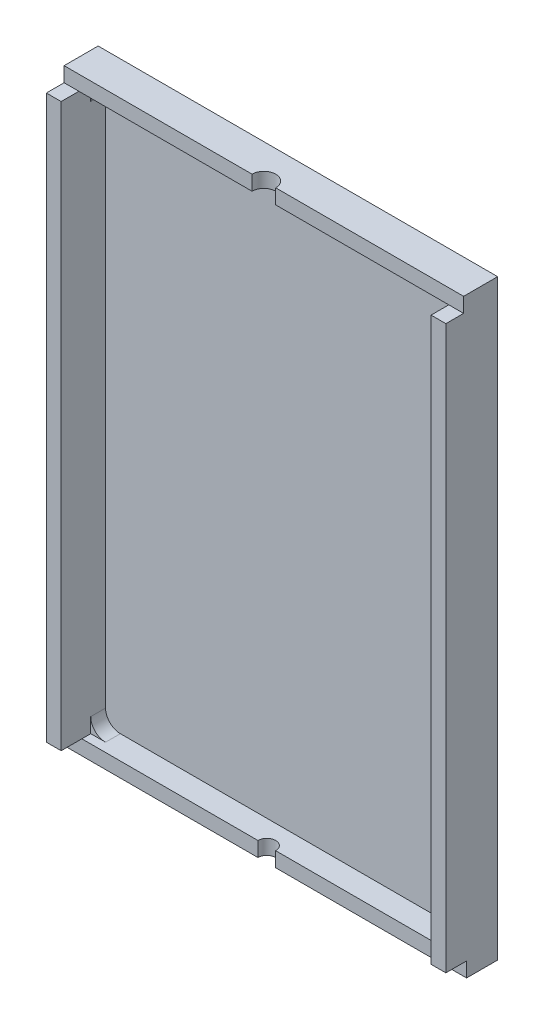
ISO-10303-21;
HEADER;
FILE_DESCRIPTION(('STEP AP214'),'2;1');
FILE_NAME('part.step','',(''),(''),'','','');
FILE_SCHEMA(('AUTOMOTIVE_DESIGN { 1 0 10303 214 1 1 1 1 }'));
ENDSEC;
DATA;
#1=APPLICATION_CONTEXT('core data for automotive mechanical design processes');
#2=APPLICATION_PROTOCOL_DEFINITION('international standard','automotive_design',2000,#1);
#3=PRODUCT_CONTEXT('',#1,'mechanical');
#4=PRODUCT('Part','Part','',(#3));
#5=PRODUCT_RELATED_PRODUCT_CATEGORY('part','',(#4));
#6=PRODUCT_DEFINITION_FORMATION('','',#4);
#7=PRODUCT_DEFINITION_CONTEXT('part definition',#1,'design');
#8=PRODUCT_DEFINITION('design','',#6,#7);
#9=PRODUCT_DEFINITION_SHAPE('','',#8);
#10=(LENGTH_UNIT() NAMED_UNIT(*) SI_UNIT(.MILLI.,.METRE.));
#11=(NAMED_UNIT(*) PLANE_ANGLE_UNIT() SI_UNIT($,.RADIAN.));
#12=(NAMED_UNIT(*) SI_UNIT($,.STERADIAN.) SOLID_ANGLE_UNIT());
#13=UNCERTAINTY_MEASURE_WITH_UNIT(LENGTH_MEASURE(1.E-05),#10,'distance_accuracy_value','');
#14=(GEOMETRIC_REPRESENTATION_CONTEXT(3) GLOBAL_UNCERTAINTY_ASSIGNED_CONTEXT((#13)) GLOBAL_UNIT_ASSIGNED_CONTEXT((#10,
#11,#12)) REPRESENTATION_CONTEXT('',''));
#15=CARTESIAN_POINT('',(0.,0.,0.));
#16=DIRECTION('',(0.,0.,1.));
#17=DIRECTION('',(1.,0.,0.));
#18=AXIS2_PLACEMENT_3D('',#15,#16,#17);
#19=CARTESIAN_POINT('',(2.,39.,1.5));
#20=DIRECTION('',(0.,-1.,0.));
#21=DIRECTION('',(0.,0.,-1.));
#22=AXIS2_PLACEMENT_3D('',#19,#20,#21);
#23=PLANE('',#22);
#24=DIRECTION('',(1.,0.,0.));
#25=VECTOR('',#24,1.);
#26=CARTESIAN_POINT('',(0.,39.,2.3));
#27=LINE('',#26,#25);
#28=CARTESIAN_POINT('',(1.,39.,2.3));
#29=VERTEX_POINT('',#28);
#30=CARTESIAN_POINT('',(12.7,39.,2.3));
#31=VERTEX_POINT('',#30);
#32=EDGE_CURVE('E295',#29,#31,#27,.T.);
#33=ORIENTED_EDGE('',*,*,#32,.F.);
#34=DIRECTION('',(0.,0.,-1.));
#35=VECTOR('',#34,1.);
#36=CARTESIAN_POINT('',(1.,39.,3.5));
#37=LINE('',#36,#35);
#38=CARTESIAN_POINT('',(1.,39.,1.5));
#39=VERTEX_POINT('',#38);
#40=EDGE_CURVE('E422',#29,#39,#37,.T.);
#41=ORIENTED_EDGE('',*,*,#40,.T.);
#42=DIRECTION('',(1.,0.,0.));
#43=VECTOR('',#42,1.);
#44=CARTESIAN_POINT('',(0.,39.,1.5));
#45=LINE('',#44,#43);
#46=CARTESIAN_POINT('',(2.,39.,1.5));
#47=VERTEX_POINT('',#46);
#48=EDGE_CURVE('E285',#39,#47,#45,.T.);
#49=ORIENTED_EDGE('',*,*,#48,.T.);
#50=DIRECTION('',(0.,0.,-1.));
#51=VECTOR('',#50,1.);
#52=CARTESIAN_POINT('',(2.,39.,1.5));
#53=LINE('',#52,#51);
#54=CARTESIAN_POINT('',(2.,39.,0.5));
#55=VERTEX_POINT('',#54);
#56=EDGE_CURVE('E353',#47,#55,#53,.T.);
#57=ORIENTED_EDGE('',*,*,#56,.T.);
#58=DIRECTION('',(-1.,0.,0.));
#59=VECTOR('',#58,1.);
#60=CARTESIAN_POINT('',(2.,39.,0.5));
#61=LINE('',#60,#59);
#62=CARTESIAN_POINT('',(25.,39.,0.5));
#63=VERTEX_POINT('',#62);
#64=EDGE_CURVE('E322',#63,#55,#61,.T.);
#65=ORIENTED_EDGE('',*,*,#64,.F.);
#66=DIRECTION('',(0.,0.,-1.));
#67=VECTOR('',#66,1.);
#68=CARTESIAN_POINT('',(25.,39.,1.5));
#69=LINE('',#68,#67);
#70=CARTESIAN_POINT('',(25.,39.,1.5));
#71=VERTEX_POINT('',#70);
#72=EDGE_CURVE('E355',#71,#63,#69,.T.);
#73=ORIENTED_EDGE('',*,*,#72,.F.);
#74=CARTESIAN_POINT('',(26.,39.,1.5));
#75=VERTEX_POINT('',#74);
#76=EDGE_CURVE('E305',#71,#75,#45,.T.);
#77=ORIENTED_EDGE('',*,*,#76,.T.);
#78=DIRECTION('',(0.,0.,-1.));
#79=VECTOR('',#78,1.);
#80=CARTESIAN_POINT('',(26.,39.,3.5));
#81=LINE('',#80,#79);
#82=CARTESIAN_POINT('',(26.,39.,2.3));
#83=VERTEX_POINT('',#82);
#84=EDGE_CURVE('E256',#83,#75,#81,.T.);
#85=ORIENTED_EDGE('',*,*,#84,.F.);
#86=CARTESIAN_POINT('',(14.3,39.,2.3));
#87=VERTEX_POINT('',#86);
#88=EDGE_CURVE('E296',#87,#83,#27,.T.);
#89=ORIENTED_EDGE('',*,*,#88,.F.);
#90=CARTESIAN_POINT('',(13.5,39.,2.3));
#91=DIRECTION('',(0.,-1.,0.));
#92=DIRECTION('',(0.,0.,-1.));
#93=AXIS2_PLACEMENT_3D('',#90,#91,#92);
#94=CIRCLE('',#93,0.800000000000001);
#95=EDGE_CURVE('E56',#31,#87,#94,.T.);
#96=ORIENTED_EDGE('',*,*,#95,.F.);
#97=EDGE_LOOP('',(#33,#41,#49,#57,#65,#73,#77,#85,#89,#96));
#98=FACE_BOUND('',#97,.T.);
#99=ADVANCED_FACE('F33',(#98),#23,.T.);
#100=CARTESIAN_POINT('',(2.,1.,1.5));
#101=DIRECTION('',(0.,1.,0.));
#102=DIRECTION('',(-1.,0.,0.));
#103=AXIS2_PLACEMENT_3D('',#100,#101,#102);
#104=PLANE('',#103);
#105=DIRECTION('',(-1.,0.,0.));
#106=VECTOR('',#105,1.);
#107=CARTESIAN_POINT('',(0.,1.,1.5));
#108=LINE('',#107,#106);
#109=CARTESIAN_POINT('',(2.,1.,1.5));
#110=VERTEX_POINT('',#109);
#111=CARTESIAN_POINT('',(1.,1.,1.5));
#112=VERTEX_POINT('',#111);
#113=EDGE_CURVE('E264',#110,#112,#108,.T.);
#114=ORIENTED_EDGE('',*,*,#113,.T.);
#115=DIRECTION('',(0.,0.,-1.));
#116=VECTOR('',#115,1.);
#117=CARTESIAN_POINT('',(1.,1.,3.5));
#118=LINE('',#117,#116);
#119=CARTESIAN_POINT('',(1.,1.,2.1));
#120=VERTEX_POINT('',#119);
#121=EDGE_CURVE('E237',#120,#112,#118,.T.);
#122=ORIENTED_EDGE('',*,*,#121,.F.);
#123=DIRECTION('',(-1.,0.,0.));
#124=VECTOR('',#123,1.);
#125=CARTESIAN_POINT('',(0.,1.,2.1));
#126=LINE('',#125,#124);
#127=CARTESIAN_POINT('',(12.9,1.,2.1));
#128=VERTEX_POINT('',#127);
#129=EDGE_CURVE('E280',#128,#120,#126,.T.);
#130=ORIENTED_EDGE('',*,*,#129,.F.);
#131=CARTESIAN_POINT('',(13.5,1.,2.1));
#132=DIRECTION('',(0.,-1.,0.));
#133=DIRECTION('',(0.,0.,-1.));
#134=AXIS2_PLACEMENT_3D('',#131,#132,#133);
#135=CIRCLE('',#134,0.6);
#136=CARTESIAN_POINT('',(14.1,1.,2.1));
#137=VERTEX_POINT('',#136);
#138=EDGE_CURVE('E48',#128,#137,#135,.T.);
#139=ORIENTED_EDGE('',*,*,#138,.T.);
#140=CARTESIAN_POINT('',(26.,1.,2.1));
#141=VERTEX_POINT('',#140);
#142=EDGE_CURVE('E279',#141,#137,#126,.T.);
#143=ORIENTED_EDGE('',*,*,#142,.F.);
#144=DIRECTION('',(0.,0.,-1.));
#145=VECTOR('',#144,1.);
#146=CARTESIAN_POINT('',(26.,1.,1.5));
#147=LINE('',#146,#145);
#148=CARTESIAN_POINT('',(26.,1.,1.5));
#149=VERTEX_POINT('',#148);
#150=EDGE_CURVE('E11',#141,#149,#147,.T.);
#151=ORIENTED_EDGE('',*,*,#150,.T.);
#152=CARTESIAN_POINT('',(25.,1.,1.5));
#153=VERTEX_POINT('',#152);
#154=EDGE_CURVE('E268',#149,#153,#108,.T.);
#155=ORIENTED_EDGE('',*,*,#154,.T.);
#156=DIRECTION('',(0.,0.,-1.));
#157=VECTOR('',#156,1.);
#158=CARTESIAN_POINT('',(25.,1.,1.5));
#159=LINE('',#158,#157);
#160=CARTESIAN_POINT('',(25.,1.,0.5));
#161=VERTEX_POINT('',#160);
#162=EDGE_CURVE('E345',#153,#161,#159,.T.);
#163=ORIENTED_EDGE('',*,*,#162,.T.);
#164=DIRECTION('',(1.,0.,0.));
#165=VECTOR('',#164,1.);
#166=CARTESIAN_POINT('',(2.,1.,0.5));
#167=LINE('',#166,#165);
#168=CARTESIAN_POINT('',(2.,1.,0.5));
#169=VERTEX_POINT('',#168);
#170=EDGE_CURVE('E334',#169,#161,#167,.T.);
#171=ORIENTED_EDGE('',*,*,#170,.F.);
#172=DIRECTION('',(0.,0.,-1.));
#173=VECTOR('',#172,1.);
#174=CARTESIAN_POINT('',(2.,1.,1.5));
#175=LINE('',#174,#173);
#176=EDGE_CURVE('E347',#110,#169,#175,.T.);
#177=ORIENTED_EDGE('',*,*,#176,.F.);
#178=EDGE_LOOP('',(#114,#122,#130,#139,#143,#151,#155,#163,#171,#177));
#179=FACE_BOUND('',#178,.T.);
#180=ADVANCED_FACE('F407',(#179),#104,.T.);
#181=CARTESIAN_POINT('',(0.,0.,1.5));
#182=DIRECTION('',(0.,0.,-1.));
#183=DIRECTION('',(-1.,0.,0.));
#184=AXIS2_PLACEMENT_3D('',#181,#182,#183);
#185=PLANE('',#184);
#186=DIRECTION('',(0.,1.,0.));
#187=VECTOR('',#186,1.);
#188=CARTESIAN_POINT('',(1.,1.,1.5));
#189=LINE('',#188,#187);
#190=CARTESIAN_POINT('',(1.,2.,1.5));
#191=VERTEX_POINT('',#190);
#192=EDGE_CURVE('E227',#112,#191,#189,.T.);
#193=ORIENTED_EDGE('',*,*,#192,.F.);
#194=ORIENTED_EDGE('',*,*,#113,.F.);
#195=CARTESIAN_POINT('',(2.,2.,1.5));
#196=DIRECTION('',(0.,0.,1.));
#197=DIRECTION('',(1.,0.,0.));
#198=AXIS2_PLACEMENT_3D('',#195,#196,#197);
#199=CIRCLE('',#198,1.);
#200=EDGE_CURVE('E313',#191,#110,#199,.T.);
#201=ORIENTED_EDGE('',*,*,#200,.F.);
#202=EDGE_LOOP('',(#193,#194,#201));
#203=FACE_BOUND('',#202,.T.);
#204=ADVANCED_FACE('F463',(#203),#185,.F.);
#205=CARTESIAN_POINT('',(1.,38.,1.5));
#206=VERTEX_POINT('',#205);
#207=EDGE_CURVE('E430',#206,#39,#189,.T.);
#208=ORIENTED_EDGE('',*,*,#207,.F.);
#209=CARTESIAN_POINT('',(2.,38.,1.5));
#210=DIRECTION('',(0.,0.,1.));
#211=DIRECTION('',(1.,0.,0.));
#212=AXIS2_PLACEMENT_3D('',#209,#210,#211);
#213=CIRCLE('',#212,1.);
#214=EDGE_CURVE('E309',#47,#206,#213,.T.);
#215=ORIENTED_EDGE('',*,*,#214,.F.);
#216=ORIENTED_EDGE('',*,*,#48,.F.);
#217=EDGE_LOOP('',(#208,#215,#216));
#218=FACE_BOUND('',#217,.T.);
#219=ADVANCED_FACE('F477',(#218),#185,.F.);
#220=DIRECTION('',(0.,-1.,0.));
#221=VECTOR('',#220,1.);
#222=CARTESIAN_POINT('',(26.,1.,1.5));
#223=LINE('',#222,#221);
#224=CARTESIAN_POINT('',(26.,38.,1.5));
#225=VERTEX_POINT('',#224);
#226=EDGE_CURVE('E235',#75,#225,#223,.T.);
#227=ORIENTED_EDGE('',*,*,#226,.F.);
#228=ORIENTED_EDGE('',*,*,#76,.F.);
#229=CARTESIAN_POINT('',(25.,38.,1.5));
#230=DIRECTION('',(0.,0.,1.));
#231=DIRECTION('',(1.,0.,0.));
#232=AXIS2_PLACEMENT_3D('',#229,#230,#231);
#233=CIRCLE('',#232,1.);
#234=EDGE_CURVE('E306',#225,#71,#233,.T.);
#235=ORIENTED_EDGE('',*,*,#234,.F.);
#236=EDGE_LOOP('',(#227,#228,#235));
#237=FACE_BOUND('',#236,.T.);
#238=ADVANCED_FACE('F473',(#237),#185,.F.);
#239=CARTESIAN_POINT('',(26.,2.,1.5));
#240=VERTEX_POINT('',#239);
#241=EDGE_CURVE('E233',#240,#149,#223,.T.);
#242=ORIENTED_EDGE('',*,*,#241,.F.);
#243=CARTESIAN_POINT('',(25.,2.,1.5));
#244=DIRECTION('',(0.,0.,1.));
#245=DIRECTION('',(1.,0.,0.));
#246=AXIS2_PLACEMENT_3D('',#243,#244,#245);
#247=CIRCLE('',#246,1.);
#248=EDGE_CURVE('E316',#153,#240,#247,.T.);
#249=ORIENTED_EDGE('',*,*,#248,.F.);
#250=ORIENTED_EDGE('',*,*,#154,.F.);
#251=EDGE_LOOP('',(#242,#249,#250));
#252=FACE_BOUND('',#251,.T.);
#253=ADVANCED_FACE('F476',(#252),#185,.F.);
#254=CARTESIAN_POINT('',(0.,0.,2.1));
#255=DIRECTION('',(0.,0.,-1.));
#256=DIRECTION('',(-1.,0.,0.));
#257=AXIS2_PLACEMENT_3D('',#254,#255,#256);
#258=PLANE('',#257);
#259=CARTESIAN_POINT('',(27.,1.,2.1));
#260=VERTEX_POINT('',#259);
#261=EDGE_CURVE('E276',#260,#141,#126,.T.);
#262=ORIENTED_EDGE('',*,*,#261,.T.);
#263=ORIENTED_EDGE('',*,*,#142,.T.);
#264=DIRECTION('',(0.,-1.,0.));
#265=VECTOR('',#264,1.);
#266=CARTESIAN_POINT('',(14.1,1.,2.1));
#267=LINE('',#266,#265);
#268=CARTESIAN_POINT('',(14.1,0.,2.1));
#269=VERTEX_POINT('',#268);
#270=EDGE_CURVE('E41',#137,#269,#267,.T.);
#271=ORIENTED_EDGE('',*,*,#270,.T.);
#272=DIRECTION('',(1.,0.,0.));
#273=VECTOR('',#272,1.);
#274=CARTESIAN_POINT('',(0.,0.,2.1));
#275=LINE('',#274,#273);
#276=CARTESIAN_POINT('',(27.,0.,2.1));
#277=VERTEX_POINT('',#276);
#278=EDGE_CURVE('E267',#269,#277,#275,.T.);
#279=ORIENTED_EDGE('',*,*,#278,.T.);
#280=DIRECTION('',(0.,1.,0.));
#281=VECTOR('',#280,1.);
#282=CARTESIAN_POINT('',(27.,0.,2.1));
#283=LINE('',#282,#281);
#284=EDGE_CURVE('E272',#277,#260,#283,.T.);
#285=ORIENTED_EDGE('',*,*,#284,.T.);
#286=EDGE_LOOP('',(#262,#263,#271,#279,#285));
#287=FACE_BOUND('',#286,.T.);
#288=ADVANCED_FACE('F386',(#287),#258,.F.);
#289=CARTESIAN_POINT('',(0.,0.,2.3));
#290=DIRECTION('',(0.,0.,1.));
#291=DIRECTION('',(1.,0.,0.));
#292=AXIS2_PLACEMENT_3D('',#289,#290,#291);
#293=PLANE('',#292);
#294=DIRECTION('',(0.,-1.,0.));
#295=VECTOR('',#294,1.);
#296=CARTESIAN_POINT('',(12.7,40.,2.3));
#297=LINE('',#296,#295);
#298=CARTESIAN_POINT('',(12.7,40.,2.3));
#299=VERTEX_POINT('',#298);
#300=EDGE_CURVE('E380',#299,#31,#297,.T.);
#301=ORIENTED_EDGE('',*,*,#300,.F.);
#302=DIRECTION('',(-1.,0.,0.));
#303=VECTOR('',#302,1.);
#304=CARTESIAN_POINT('',(0.,40.,2.3));
#305=LINE('',#304,#303);
#306=CARTESIAN_POINT('',(0.,40.,2.3));
#307=VERTEX_POINT('',#306);
#308=EDGE_CURVE('E299',#299,#307,#305,.T.);
#309=ORIENTED_EDGE('',*,*,#308,.T.);
#310=DIRECTION('',(0.,-1.,0.));
#311=VECTOR('',#310,1.);
#312=CARTESIAN_POINT('',(0.,40.,2.3));
#313=LINE('',#312,#311);
#314=CARTESIAN_POINT('',(0.,39.,2.3));
#315=VERTEX_POINT('',#314);
#316=EDGE_CURVE('E287',#307,#315,#313,.T.);
#317=ORIENTED_EDGE('',*,*,#316,.T.);
#318=EDGE_CURVE('E291',#315,#29,#27,.T.);
#319=ORIENTED_EDGE('',*,*,#318,.T.);
#320=ORIENTED_EDGE('',*,*,#32,.T.);
#321=EDGE_LOOP('',(#301,#309,#317,#319,#320));
#322=FACE_BOUND('',#321,.T.);
#323=ADVANCED_FACE('F436',(#322),#293,.T.);
#324=CARTESIAN_POINT('',(0.,0.,0.5));
#325=DIRECTION('',(1.,0.,0.));
#326=DIRECTION('',(0.,0.,-1.));
#327=AXIS2_PLACEMENT_3D('',#324,#325,#326);
#328=PLANE('',#327);
#329=DIRECTION('',(0.,-1.,0.));
#330=VECTOR('',#329,1.);
#331=CARTESIAN_POINT('',(0.,0.,0.));
#332=LINE('',#331,#330);
#333=CARTESIAN_POINT('',(0.,40.,0.));
#334=VERTEX_POINT('',#333);
#335=CARTESIAN_POINT('',(0.,0.,0.));
#336=VERTEX_POINT('',#335);
#337=EDGE_CURVE('E358',#334,#336,#332,.T.);
#338=ORIENTED_EDGE('',*,*,#337,.T.);
#339=DIRECTION('',(0.,0.,-1.));
#340=VECTOR('',#339,1.);
#341=CARTESIAN_POINT('',(0.,0.,0.5));
#342=LINE('',#341,#340);
#343=CARTESIAN_POINT('',(0.,0.,2.1));
#344=VERTEX_POINT('',#343);
#345=EDGE_CURVE('E375',#344,#336,#342,.T.);
#346=ORIENTED_EDGE('',*,*,#345,.F.);
#347=DIRECTION('',(0.,-1.,0.));
#348=VECTOR('',#347,1.);
#349=CARTESIAN_POINT('',(0.,0.,2.1));
#350=LINE('',#349,#348);
#351=CARTESIAN_POINT('',(0.,1.,2.1));
#352=VERTEX_POINT('',#351);
#353=EDGE_CURVE('E232',#352,#344,#350,.T.);
#354=ORIENTED_EDGE('',*,*,#353,.F.);
#355=DIRECTION('',(0.,0.,-1.));
#356=VECTOR('',#355,1.);
#357=CARTESIAN_POINT('',(0.,1.,3.5));
#358=LINE('',#357,#356);
#359=CARTESIAN_POINT('',(0.,1.,3.5));
#360=VERTEX_POINT('',#359);
#361=EDGE_CURVE('E211',#360,#352,#358,.T.);
#362=ORIENTED_EDGE('',*,*,#361,.F.);
#363=DIRECTION('',(0.,-1.,0.));
#364=VECTOR('',#363,1.);
#365=CARTESIAN_POINT('',(0.,1.,3.5));
#366=LINE('',#365,#364);
#367=CARTESIAN_POINT('',(0.,39.,3.5));
#368=VERTEX_POINT('',#367);
#369=EDGE_CURVE('E218',#368,#360,#366,.T.);
#370=ORIENTED_EDGE('',*,*,#369,.F.);
#371=DIRECTION('',(0.,0.,-1.));
#372=VECTOR('',#371,1.);
#373=CARTESIAN_POINT('',(0.,39.,3.5));
#374=LINE('',#373,#372);
#375=EDGE_CURVE('E426',#368,#315,#374,.T.);
#376=ORIENTED_EDGE('',*,*,#375,.T.);
#377=ORIENTED_EDGE('',*,*,#316,.F.);
#378=DIRECTION('',(0.,0.,-1.));
#379=VECTOR('',#378,1.);
#380=CARTESIAN_POINT('',(0.,40.,0.5));
#381=LINE('',#380,#379);
#382=EDGE_CURVE('E366',#307,#334,#381,.T.);
#383=ORIENTED_EDGE('',*,*,#382,.T.);
#384=EDGE_LOOP('',(#338,#346,#354,#362,#370,#376,#377,#383));
#385=FACE_BOUND('',#384,.T.);
#386=ADVANCED_FACE('F35',(#385),#328,.F.);
#387=CARTESIAN_POINT('',(0.,0.,0.5));
#388=DIRECTION('',(0.,1.,0.));
#389=DIRECTION('',(0.,0.,1.));
#390=AXIS2_PLACEMENT_3D('',#387,#388,#389);
#391=PLANE('',#390);
#392=ORIENTED_EDGE('',*,*,#278,.F.);
#393=CARTESIAN_POINT('',(13.5,0.,2.1));
#394=DIRECTION('',(0.,-1.,0.));
#395=DIRECTION('',(0.,0.,-1.));
#396=AXIS2_PLACEMENT_3D('',#393,#394,#395);
#397=CIRCLE('',#396,0.6);
#398=CARTESIAN_POINT('',(12.9,0.,2.1));
#399=VERTEX_POINT('',#398);
#400=EDGE_CURVE('E262',#399,#269,#397,.T.);
#401=ORIENTED_EDGE('',*,*,#400,.F.);
#402=EDGE_CURVE('E269',#344,#399,#275,.T.);
#403=ORIENTED_EDGE('',*,*,#402,.F.);
#404=ORIENTED_EDGE('',*,*,#345,.T.);
#405=DIRECTION('',(1.,0.,0.));
#406=VECTOR('',#405,1.);
#407=CARTESIAN_POINT('',(0.,0.,0.));
#408=LINE('',#407,#406);
#409=CARTESIAN_POINT('',(27.,0.,0.));
#410=VERTEX_POINT('',#409);
#411=EDGE_CURVE('E360',#336,#410,#408,.T.);
#412=ORIENTED_EDGE('',*,*,#411,.T.);
#413=DIRECTION('',(0.,0.,-1.));
#414=VECTOR('',#413,1.);
#415=CARTESIAN_POINT('',(27.,0.,0.5));
#416=LINE('',#415,#414);
#417=EDGE_CURVE('E372',#277,#410,#416,.T.);
#418=ORIENTED_EDGE('',*,*,#417,.F.);
#419=EDGE_LOOP('',(#392,#401,#403,#404,#412,#418));
#420=FACE_BOUND('',#419,.T.);
#421=ADVANCED_FACE('F391',(#420),#391,.F.);
#422=CARTESIAN_POINT('',(27.,0.,0.5));
#423=DIRECTION('',(-1.,0.,0.));
#424=DIRECTION('',(0.,0.,1.));
#425=AXIS2_PLACEMENT_3D('',#422,#423,#424);
#426=PLANE('',#425);
#427=DIRECTION('',(0.,1.,0.));
#428=VECTOR('',#427,1.);
#429=CARTESIAN_POINT('',(27.,0.,0.));
#430=LINE('',#429,#428);
#431=CARTESIAN_POINT('',(27.,40.,0.));
#432=VERTEX_POINT('',#431);
#433=EDGE_CURVE('E362',#410,#432,#430,.T.);
#434=ORIENTED_EDGE('',*,*,#433,.T.);
#435=DIRECTION('',(0.,0.,-1.));
#436=VECTOR('',#435,1.);
#437=CARTESIAN_POINT('',(27.,40.,0.5));
#438=LINE('',#437,#436);
#439=CARTESIAN_POINT('',(27.,40.,2.3));
#440=VERTEX_POINT('',#439);
#441=EDGE_CURVE('E369',#440,#432,#438,.T.);
#442=ORIENTED_EDGE('',*,*,#441,.F.);
#443=DIRECTION('',(0.,1.,0.));
#444=VECTOR('',#443,1.);
#445=CARTESIAN_POINT('',(27.,40.,2.3));
#446=LINE('',#445,#444);
#447=CARTESIAN_POINT('',(27.,39.,2.3));
#448=VERTEX_POINT('',#447);
#449=EDGE_CURVE('E294',#448,#440,#446,.T.);
#450=ORIENTED_EDGE('',*,*,#449,.F.);
#451=DIRECTION('',(0.,0.,-1.));
#452=VECTOR('',#451,1.);
#453=CARTESIAN_POINT('',(27.,39.,3.5));
#454=LINE('',#453,#452);
#455=CARTESIAN_POINT('',(27.,39.,3.5));
#456=VERTEX_POINT('',#455);
#457=EDGE_CURVE('E260',#456,#448,#454,.T.);
#458=ORIENTED_EDGE('',*,*,#457,.F.);
#459=DIRECTION('',(0.,1.,0.));
#460=VECTOR('',#459,1.);
#461=CARTESIAN_POINT('',(27.,1.,3.5));
#462=LINE('',#461,#460);
#463=CARTESIAN_POINT('',(27.,1.,3.5));
#464=VERTEX_POINT('',#463);
#465=EDGE_CURVE('E241',#464,#456,#462,.T.);
#466=ORIENTED_EDGE('',*,*,#465,.F.);
#467=DIRECTION('',(0.,0.,-1.));
#468=VECTOR('',#467,1.);
#469=CARTESIAN_POINT('',(27.,1.,3.5));
#470=LINE('',#469,#468);
#471=EDGE_CURVE('E249',#464,#260,#470,.T.);
#472=ORIENTED_EDGE('',*,*,#471,.T.);
#473=ORIENTED_EDGE('',*,*,#284,.F.);
#474=ORIENTED_EDGE('',*,*,#417,.T.);
#475=EDGE_LOOP('',(#434,#442,#450,#458,#466,#472,#473,#474));
#476=FACE_BOUND('',#475,.T.);
#477=ADVANCED_FACE('F396',(#476),#426,.F.);
#478=CARTESIAN_POINT('',(0.,40.,0.5));
#479=DIRECTION('',(0.,-1.,0.));
#480=DIRECTION('',(0.,0.,-1.));
#481=AXIS2_PLACEMENT_3D('',#478,#479,#480);
#482=PLANE('',#481);
#483=ORIENTED_EDGE('',*,*,#308,.F.);
#484=CARTESIAN_POINT('',(13.5,40.,2.3));
#485=DIRECTION('',(0.,-1.,0.));
#486=DIRECTION('',(0.,0.,-1.));
#487=AXIS2_PLACEMENT_3D('',#484,#485,#486);
#488=CIRCLE('',#487,0.800000000000001);
#489=CARTESIAN_POINT('',(14.3,40.,2.3));
#490=VERTEX_POINT('',#489);
#491=EDGE_CURVE('E282',#299,#490,#488,.T.);
#492=ORIENTED_EDGE('',*,*,#491,.T.);
#493=EDGE_CURVE('E300',#440,#490,#305,.T.);
#494=ORIENTED_EDGE('',*,*,#493,.F.);
#495=ORIENTED_EDGE('',*,*,#441,.T.);
#496=DIRECTION('',(-1.,0.,0.));
#497=VECTOR('',#496,1.);
#498=CARTESIAN_POINT('',(0.,40.,0.));
#499=LINE('',#498,#497);
#500=EDGE_CURVE('E364',#432,#334,#499,.T.);
#501=ORIENTED_EDGE('',*,*,#500,.T.);
#502=ORIENTED_EDGE('',*,*,#382,.F.);
#503=EDGE_LOOP('',(#483,#492,#494,#495,#501,#502));
#504=FACE_BOUND('',#503,.T.);
#505=ADVANCED_FACE('F440',(#504),#482,.F.);
#506=CARTESIAN_POINT('',(0.,0.,0.));
#507=DIRECTION('',(0.,0.,-1.));
#508=DIRECTION('',(-1.,0.,0.));
#509=AXIS2_PLACEMENT_3D('',#506,#507,#508);
#510=PLANE('',#509);
#511=ORIENTED_EDGE('',*,*,#337,.F.);
#512=ORIENTED_EDGE('',*,*,#500,.F.);
#513=ORIENTED_EDGE('',*,*,#433,.F.);
#514=ORIENTED_EDGE('',*,*,#411,.F.);
#515=EDGE_LOOP('',(#511,#512,#513,#514));
#516=FACE_BOUND('',#515,.T.);
#517=ADVANCED_FACE('F444',(#516),#510,.T.);
#518=CARTESIAN_POINT('',(25.,38.,1.5));
#519=DIRECTION('',(0.,0.,-1.));
#520=DIRECTION('',(-1.,0.,0.));
#521=AXIS2_PLACEMENT_3D('',#518,#519,#520);
#522=CYLINDRICAL_SURFACE('',#521,1.);
#523=CARTESIAN_POINT('',(25.,38.,0.5));
#524=DIRECTION('',(0.,0.,1.));
#525=DIRECTION('',(1.,0.,0.));
#526=AXIS2_PLACEMENT_3D('',#523,#524,#525);
#527=CIRCLE('',#526,1.);
#528=CARTESIAN_POINT('',(26.,38.,0.5));
#529=VERTEX_POINT('',#528);
#530=EDGE_CURVE('E303',#529,#63,#527,.T.);
#531=ORIENTED_EDGE('',*,*,#530,.F.);
#532=DIRECTION('',(0.,0.,-1.));
#533=VECTOR('',#532,1.);
#534=CARTESIAN_POINT('',(26.,38.,1.5));
#535=LINE('',#534,#533);
#536=EDGE_CURVE('E319',#225,#529,#535,.T.);
#537=ORIENTED_EDGE('',*,*,#536,.F.);
#538=ORIENTED_EDGE('',*,*,#234,.T.);
#539=ORIENTED_EDGE('',*,*,#72,.T.);
#540=EDGE_LOOP('',(#531,#537,#538,#539));
#541=FACE_BOUND('',#540,.T.);
#542=ADVANCED_FACE('F469',(#541),#522,.F.);
#543=CARTESIAN_POINT('',(2.,38.,1.5));
#544=DIRECTION('',(0.,0.,-1.));
#545=DIRECTION('',(-1.,0.,0.));
#546=AXIS2_PLACEMENT_3D('',#543,#544,#545);
#547=CYLINDRICAL_SURFACE('',#546,1.);
#548=CARTESIAN_POINT('',(2.,38.,0.5));
#549=DIRECTION('',(0.,0.,1.));
#550=DIRECTION('',(1.,0.,0.));
#551=AXIS2_PLACEMENT_3D('',#548,#549,#550);
#552=CIRCLE('',#551,1.);
#553=CARTESIAN_POINT('',(1.,38.,0.5));
#554=VERTEX_POINT('',#553);
#555=EDGE_CURVE('E325',#55,#554,#552,.T.);
#556=ORIENTED_EDGE('',*,*,#555,.F.);
#557=ORIENTED_EDGE('',*,*,#56,.F.);
#558=ORIENTED_EDGE('',*,*,#214,.T.);
#559=DIRECTION('',(0.,0.,-1.));
#560=VECTOR('',#559,1.);
#561=CARTESIAN_POINT('',(1.,38.,1.5));
#562=LINE('',#561,#560);
#563=EDGE_CURVE('E351',#206,#554,#562,.T.);
#564=ORIENTED_EDGE('',*,*,#563,.T.);
#565=EDGE_LOOP('',(#556,#557,#558,#564));
#566=FACE_BOUND('',#565,.T.);
#567=ADVANCED_FACE('F467',(#566),#547,.F.);
#568=CARTESIAN_POINT('',(1.,2.,1.5));
#569=DIRECTION('',(1.,0.,0.));
#570=DIRECTION('',(0.,0.,-1.));
#571=AXIS2_PLACEMENT_3D('',#568,#569,#570);
#572=PLANE('',#571);
#573=DIRECTION('',(0.,-1.,0.));
#574=VECTOR('',#573,1.);
#575=CARTESIAN_POINT('',(1.,2.,0.5));
#576=LINE('',#575,#574);
#577=CARTESIAN_POINT('',(1.,2.,0.5));
#578=VERTEX_POINT('',#577);
#579=EDGE_CURVE('E328',#554,#578,#576,.T.);
#580=ORIENTED_EDGE('',*,*,#579,.F.);
#581=ORIENTED_EDGE('',*,*,#563,.F.);
#582=ORIENTED_EDGE('',*,*,#207,.T.);
#583=ORIENTED_EDGE('',*,*,#40,.F.);
#584=CARTESIAN_POINT('',(1.,39.,3.5));
#585=VERTEX_POINT('',#584);
#586=EDGE_CURVE('E420',#585,#29,#37,.T.);
#587=ORIENTED_EDGE('',*,*,#586,.F.);
#588=DIRECTION('',(0.,1.,0.));
#589=VECTOR('',#588,1.);
#590=CARTESIAN_POINT('',(1.,1.,3.5));
#591=LINE('',#590,#589);
#592=CARTESIAN_POINT('',(1.,1.,3.5));
#593=VERTEX_POINT('',#592);
#594=EDGE_CURVE('E217',#593,#585,#591,.T.);
#595=ORIENTED_EDGE('',*,*,#594,.F.);
#596=EDGE_CURVE('E214',#593,#120,#118,.T.);
#597=ORIENTED_EDGE('',*,*,#596,.T.);
#598=ORIENTED_EDGE('',*,*,#121,.T.);
#599=ORIENTED_EDGE('',*,*,#192,.T.);
#600=DIRECTION('',(0.,0.,-1.));
#601=VECTOR('',#600,1.);
#602=CARTESIAN_POINT('',(1.,2.,1.5));
#603=LINE('',#602,#601);
#604=EDGE_CURVE('E349',#191,#578,#603,.T.);
#605=ORIENTED_EDGE('',*,*,#604,.T.);
#606=EDGE_LOOP('',(#580,#581,#582,#583,#587,#595,#597,#598,#599,#605));
#607=FACE_BOUND('',#606,.T.);
#608=ADVANCED_FACE('F416',(#607),#572,.T.);
#609=CARTESIAN_POINT('',(2.,2.,1.5));
#610=DIRECTION('',(0.,0.,-1.));
#611=DIRECTION('',(-1.,0.,0.));
#612=AXIS2_PLACEMENT_3D('',#609,#610,#611);
#613=CYLINDRICAL_SURFACE('',#612,1.);
#614=CARTESIAN_POINT('',(2.,2.,0.5));
#615=DIRECTION('',(0.,0.,1.));
#616=DIRECTION('',(1.,0.,0.));
#617=AXIS2_PLACEMENT_3D('',#614,#615,#616);
#618=CIRCLE('',#617,1.);
#619=EDGE_CURVE('E331',#578,#169,#618,.T.);
#620=ORIENTED_EDGE('',*,*,#619,.F.);
#621=ORIENTED_EDGE('',*,*,#604,.F.);
#622=ORIENTED_EDGE('',*,*,#200,.T.);
#623=ORIENTED_EDGE('',*,*,#176,.T.);
#624=EDGE_LOOP('',(#620,#621,#622,#623));
#625=FACE_BOUND('',#624,.T.);
#626=ADVANCED_FACE('F537',(#625),#613,.F.);
#627=CARTESIAN_POINT('',(25.,2.,1.5));
#628=DIRECTION('',(0.,0.,-1.));
#629=DIRECTION('',(-1.,0.,0.));
#630=AXIS2_PLACEMENT_3D('',#627,#628,#629);
#631=CYLINDRICAL_SURFACE('',#630,1.);
#632=CARTESIAN_POINT('',(25.,2.,0.5));
#633=DIRECTION('',(0.,0.,1.));
#634=DIRECTION('',(1.,0.,0.));
#635=AXIS2_PLACEMENT_3D('',#632,#633,#634);
#636=CIRCLE('',#635,1.);
#637=CARTESIAN_POINT('',(26.,2.,0.5));
#638=VERTEX_POINT('',#637);
#639=EDGE_CURVE('E337',#161,#638,#636,.T.);
#640=ORIENTED_EDGE('',*,*,#639,.F.);
#641=ORIENTED_EDGE('',*,*,#162,.F.);
#642=ORIENTED_EDGE('',*,*,#248,.T.);
#643=DIRECTION('',(0.,0.,-1.));
#644=VECTOR('',#643,1.);
#645=CARTESIAN_POINT('',(26.,2.,1.5));
#646=LINE('',#645,#644);
#647=EDGE_CURVE('E343',#240,#638,#646,.T.);
#648=ORIENTED_EDGE('',*,*,#647,.T.);
#649=EDGE_LOOP('',(#640,#641,#642,#648));
#650=FACE_BOUND('',#649,.T.);
#651=ADVANCED_FACE('F531',(#650),#631,.F.);
#652=CARTESIAN_POINT('',(26.,2.,1.5));
#653=DIRECTION('',(-1.,0.,0.));
#654=DIRECTION('',(0.,0.,1.));
#655=AXIS2_PLACEMENT_3D('',#652,#653,#654);
#656=PLANE('',#655);
#657=DIRECTION('',(0.,1.,0.));
#658=VECTOR('',#657,1.);
#659=CARTESIAN_POINT('',(26.,2.,0.5));
#660=LINE('',#659,#658);
#661=EDGE_CURVE('E310',#638,#529,#660,.T.);
#662=ORIENTED_EDGE('',*,*,#661,.F.);
#663=ORIENTED_EDGE('',*,*,#647,.F.);
#664=ORIENTED_EDGE('',*,*,#241,.T.);
#665=ORIENTED_EDGE('',*,*,#150,.F.);
#666=DIRECTION('',(0.,0.,-1.));
#667=VECTOR('',#666,1.);
#668=CARTESIAN_POINT('',(26.,1.,3.5));
#669=LINE('',#668,#667);
#670=CARTESIAN_POINT('',(26.,1.,3.5));
#671=VERTEX_POINT('',#670);
#672=EDGE_CURVE('E253',#671,#141,#669,.T.);
#673=ORIENTED_EDGE('',*,*,#672,.F.);
#674=DIRECTION('',(0.,-1.,0.));
#675=VECTOR('',#674,1.);
#676=CARTESIAN_POINT('',(26.,1.,3.5));
#677=LINE('',#676,#675);
#678=CARTESIAN_POINT('',(26.,39.,3.5));
#679=VERTEX_POINT('',#678);
#680=EDGE_CURVE('E246',#679,#671,#677,.T.);
#681=ORIENTED_EDGE('',*,*,#680,.F.);
#682=EDGE_CURVE('E257',#679,#83,#81,.T.);
#683=ORIENTED_EDGE('',*,*,#682,.T.);
#684=ORIENTED_EDGE('',*,*,#84,.T.);
#685=ORIENTED_EDGE('',*,*,#226,.T.);
#686=ORIENTED_EDGE('',*,*,#536,.T.);
#687=EDGE_LOOP('',(#662,#663,#664,#665,#673,#681,#683,#684,#685,#686));
#688=FACE_BOUND('',#687,.T.);
#689=ADVANCED_FACE('F483',(#688),#656,.T.);
#690=CARTESIAN_POINT('',(0.,0.,0.5));
#691=DIRECTION('',(0.,0.,-1.));
#692=DIRECTION('',(-1.,0.,0.));
#693=AXIS2_PLACEMENT_3D('',#690,#691,#692);
#694=PLANE('',#693);
#695=ORIENTED_EDGE('',*,*,#661,.T.);
#696=ORIENTED_EDGE('',*,*,#530,.T.);
#697=ORIENTED_EDGE('',*,*,#64,.T.);
#698=ORIENTED_EDGE('',*,*,#555,.T.);
#699=ORIENTED_EDGE('',*,*,#579,.T.);
#700=ORIENTED_EDGE('',*,*,#619,.T.);
#701=ORIENTED_EDGE('',*,*,#170,.T.);
#702=ORIENTED_EDGE('',*,*,#639,.T.);
#703=EDGE_LOOP('',(#695,#696,#697,#698,#699,#700,#701,#702));
#704=FACE_BOUND('',#703,.T.);
#705=ADVANCED_FACE('F479',(#704),#694,.F.);
#706=DIRECTION('',(0.,-1.,0.));
#707=VECTOR('',#706,1.);
#708=CARTESIAN_POINT('',(14.3,40.,2.3));
#709=LINE('',#708,#707);
#710=EDGE_CURVE('E378',#87,#490,#709,.F.);
#711=ORIENTED_EDGE('',*,*,#710,.F.);
#712=ORIENTED_EDGE('',*,*,#88,.T.);
#713=EDGE_CURVE('E290',#83,#448,#27,.T.);
#714=ORIENTED_EDGE('',*,*,#713,.T.);
#715=ORIENTED_EDGE('',*,*,#449,.T.);
#716=ORIENTED_EDGE('',*,*,#493,.T.);
#717=EDGE_LOOP('',(#711,#712,#714,#715,#716));
#718=FACE_BOUND('',#717,.T.);
#719=ADVANCED_FACE('F482',(#718),#293,.T.);
#720=CARTESIAN_POINT('',(13.5,40.,2.3));
#721=DIRECTION('',(0.,-1.,0.));
#722=DIRECTION('',(0.,0.,-1.));
#723=AXIS2_PLACEMENT_3D('',#720,#721,#722);
#724=CYLINDRICAL_SURFACE('',#723,0.800000000000001);
#725=ORIENTED_EDGE('',*,*,#300,.T.);
#726=ORIENTED_EDGE('',*,*,#95,.T.);
#727=ORIENTED_EDGE('',*,*,#710,.T.);
#728=ORIENTED_EDGE('',*,*,#491,.F.);
#729=EDGE_LOOP('',(#725,#726,#727,#728));
#730=FACE_BOUND('',#729,.T.);
#731=ADVANCED_FACE('F454',(#730),#724,.F.);
#732=ORIENTED_EDGE('',*,*,#402,.T.);
#733=DIRECTION('',(0.,-1.,0.));
#734=VECTOR('',#733,1.);
#735=CARTESIAN_POINT('',(12.9,1.,2.1));
#736=LINE('',#735,#734);
#737=EDGE_CURVE('E382',#399,#128,#736,.F.);
#738=ORIENTED_EDGE('',*,*,#737,.T.);
#739=ORIENTED_EDGE('',*,*,#129,.T.);
#740=EDGE_CURVE('E275',#120,#352,#126,.T.);
#741=ORIENTED_EDGE('',*,*,#740,.T.);
#742=ORIENTED_EDGE('',*,*,#353,.T.);
#743=EDGE_LOOP('',(#732,#738,#739,#741,#742));
#744=FACE_BOUND('',#743,.T.);
#745=ADVANCED_FACE('F412',(#744),#258,.F.);
#746=CARTESIAN_POINT('',(13.5,1.,2.1));
#747=DIRECTION('',(0.,-1.,0.));
#748=DIRECTION('',(0.,0.,-1.));
#749=AXIS2_PLACEMENT_3D('',#746,#747,#748);
#750=CYLINDRICAL_SURFACE('',#749,0.6);
#751=ORIENTED_EDGE('',*,*,#138,.F.);
#752=ORIENTED_EDGE('',*,*,#737,.F.);
#753=ORIENTED_EDGE('',*,*,#400,.T.);
#754=ORIENTED_EDGE('',*,*,#270,.F.);
#755=EDGE_LOOP('',(#751,#752,#753,#754));
#756=FACE_BOUND('',#755,.T.);
#757=ADVANCED_FACE('F445',(#756),#750,.F.);
#758=CARTESIAN_POINT('',(27.,1.,3.5));
#759=DIRECTION('',(0.,1.,0.));
#760=DIRECTION('',(0.,0.,1.));
#761=AXIS2_PLACEMENT_3D('',#758,#759,#760);
#762=PLANE('',#761);
#763=ORIENTED_EDGE('',*,*,#672,.T.);
#764=ORIENTED_EDGE('',*,*,#261,.F.);
#765=ORIENTED_EDGE('',*,*,#471,.F.);
#766=DIRECTION('',(1.,0.,0.));
#767=VECTOR('',#766,1.);
#768=CARTESIAN_POINT('',(27.,1.,3.5));
#769=LINE('',#768,#767);
#770=EDGE_CURVE('E248',#671,#464,#769,.T.);
#771=ORIENTED_EDGE('',*,*,#770,.F.);
#772=EDGE_LOOP('',(#763,#764,#765,#771));
#773=FACE_BOUND('',#772,.T.);
#774=ADVANCED_FACE('F400',(#773),#762,.F.);
#775=CARTESIAN_POINT('',(27.,39.,3.5));
#776=DIRECTION('',(0.,-1.,0.));
#777=DIRECTION('',(0.,0.,-1.));
#778=AXIS2_PLACEMENT_3D('',#775,#776,#777);
#779=PLANE('',#778);
#780=ORIENTED_EDGE('',*,*,#713,.F.);
#781=ORIENTED_EDGE('',*,*,#682,.F.);
#782=DIRECTION('',(-1.,0.,0.));
#783=VECTOR('',#782,1.);
#784=CARTESIAN_POINT('',(27.,39.,3.5));
#785=LINE('',#784,#783);
#786=EDGE_CURVE('E244',#456,#679,#785,.T.);
#787=ORIENTED_EDGE('',*,*,#786,.F.);
#788=ORIENTED_EDGE('',*,*,#457,.T.);
#789=EDGE_LOOP('',(#780,#781,#787,#788));
#790=FACE_BOUND('',#789,.T.);
#791=ADVANCED_FACE('F452',(#790),#779,.F.);
#792=CARTESIAN_POINT('',(0.,0.,3.5));
#793=DIRECTION('',(0.,0.,1.));
#794=DIRECTION('',(1.,0.,0.));
#795=AXIS2_PLACEMENT_3D('',#792,#793,#794);
#796=PLANE('',#795);
#797=ORIENTED_EDGE('',*,*,#465,.T.);
#798=ORIENTED_EDGE('',*,*,#786,.T.);
#799=ORIENTED_EDGE('',*,*,#680,.T.);
#800=ORIENTED_EDGE('',*,*,#770,.T.);
#801=EDGE_LOOP('',(#797,#798,#799,#800));
#802=FACE_BOUND('',#801,.T.);
#803=ADVANCED_FACE('F519',(#802),#796,.T.);
#804=CARTESIAN_POINT('',(0.,1.,3.5));
#805=DIRECTION('',(0.,1.,0.));
#806=DIRECTION('',(0.,0.,1.));
#807=AXIS2_PLACEMENT_3D('',#804,#805,#806);
#808=PLANE('',#807);
#809=ORIENTED_EDGE('',*,*,#361,.T.);
#810=ORIENTED_EDGE('',*,*,#740,.F.);
#811=ORIENTED_EDGE('',*,*,#596,.F.);
#812=DIRECTION('',(1.,0.,0.));
#813=VECTOR('',#812,1.);
#814=CARTESIAN_POINT('',(0.,1.,3.5));
#815=LINE('',#814,#813);
#816=EDGE_CURVE('E207',#360,#593,#815,.T.);
#817=ORIENTED_EDGE('',*,*,#816,.F.);
#818=EDGE_LOOP('',(#809,#810,#811,#817));
#819=FACE_BOUND('',#818,.T.);
#820=ADVANCED_FACE('F209',(#819),#808,.F.);
#821=CARTESIAN_POINT('',(0.,39.,3.5));
#822=DIRECTION('',(0.,-1.,0.));
#823=DIRECTION('',(0.,0.,-1.));
#824=AXIS2_PLACEMENT_3D('',#821,#822,#823);
#825=PLANE('',#824);
#826=ORIENTED_EDGE('',*,*,#318,.F.);
#827=ORIENTED_EDGE('',*,*,#375,.F.);
#828=DIRECTION('',(-1.,0.,0.));
#829=VECTOR('',#828,1.);
#830=CARTESIAN_POINT('',(0.,39.,3.5));
#831=LINE('',#830,#829);
#832=EDGE_CURVE('E223',#585,#368,#831,.T.);
#833=ORIENTED_EDGE('',*,*,#832,.F.);
#834=ORIENTED_EDGE('',*,*,#586,.T.);
#835=EDGE_LOOP('',(#826,#827,#833,#834));
#836=FACE_BOUND('',#835,.T.);
#837=ADVANCED_FACE('F432',(#836),#825,.F.);
#838=CARTESIAN_POINT('',(0.,0.,3.5));
#839=DIRECTION('',(0.,0.,-1.));
#840=DIRECTION('',(-1.,0.,0.));
#841=AXIS2_PLACEMENT_3D('',#838,#839,#840);
#842=PLANE('',#841);
#843=ORIENTED_EDGE('',*,*,#369,.T.);
#844=ORIENTED_EDGE('',*,*,#816,.T.);
#845=ORIENTED_EDGE('',*,*,#594,.T.);
#846=ORIENTED_EDGE('',*,*,#832,.T.);
#847=EDGE_LOOP('',(#843,#844,#845,#846));
#848=FACE_BOUND('',#847,.T.);
#849=ADVANCED_FACE('F221',(#848),#842,.F.);
#850=CLOSED_SHELL('',(#99,#180,#204,#219,#238,#253,#288,#323,#386,#421,#477,#505,#517,#542,#567,
#608,#626,#651,#689,#705,#719,#731,#745,#757,#774,#791,#803,#820,#837,#849));
#851=MANIFOLD_SOLID_BREP('B2',#850);
#852=ADVANCED_BREP_SHAPE_REPRESENTATION('',(#18,#851),#14);
#853=SHAPE_DEFINITION_REPRESENTATION(#9,#852);
ENDSEC;
END-ISO-10303-21;
